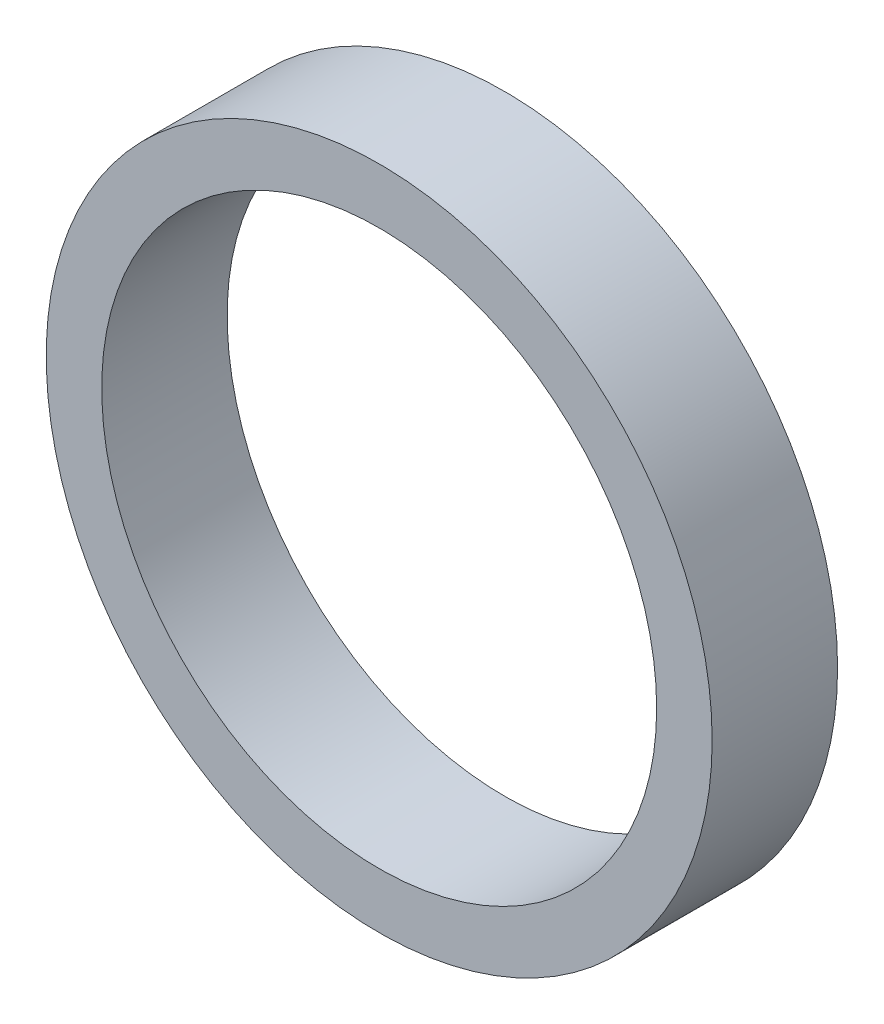
ISO-10303-21;
HEADER;
FILE_DESCRIPTION(('STEP AP214'),'2;1');
FILE_NAME('part.step','',(''),(''),'','','');
FILE_SCHEMA(('AUTOMOTIVE_DESIGN { 1 0 10303 214 1 1 1 1 }'));
ENDSEC;
DATA;
#1=APPLICATION_CONTEXT('core data for automotive mechanical design processes');
#2=APPLICATION_PROTOCOL_DEFINITION('international standard','automotive_design',2000,#1);
#3=PRODUCT_CONTEXT('',#1,'mechanical');
#4=PRODUCT('Part','Part','',(#3));
#5=PRODUCT_RELATED_PRODUCT_CATEGORY('part','',(#4));
#6=PRODUCT_DEFINITION_FORMATION('','',#4);
#7=PRODUCT_DEFINITION_CONTEXT('part definition',#1,'design');
#8=PRODUCT_DEFINITION('design','',#6,#7);
#9=PRODUCT_DEFINITION_SHAPE('','',#8);
#10=(LENGTH_UNIT() NAMED_UNIT(*) SI_UNIT(.MILLI.,.METRE.));
#11=(NAMED_UNIT(*) PLANE_ANGLE_UNIT() SI_UNIT($,.RADIAN.));
#12=(NAMED_UNIT(*) SI_UNIT($,.STERADIAN.) SOLID_ANGLE_UNIT());
#13=UNCERTAINTY_MEASURE_WITH_UNIT(LENGTH_MEASURE(1.E-05),#10,'distance_accuracy_value','');
#14=(GEOMETRIC_REPRESENTATION_CONTEXT(3) GLOBAL_UNCERTAINTY_ASSIGNED_CONTEXT((#13)) GLOBAL_UNIT_ASSIGNED_CONTEXT((#10,
#11,#12)) REPRESENTATION_CONTEXT('',''));
#15=CARTESIAN_POINT('',(0.,0.,0.));
#16=DIRECTION('',(0.,0.,1.));
#17=DIRECTION('',(1.,0.,0.));
#18=AXIS2_PLACEMENT_3D('',#15,#16,#17);
#19=CARTESIAN_POINT('',(0.,0.,5.65));
#20=DIRECTION('',(0.,0.,1.));
#21=DIRECTION('',(1.,0.,0.));
#22=AXIS2_PLACEMENT_3D('',#19,#20,#21);
#23=PLANE('',#22);
#24=CARTESIAN_POINT('',(0.,0.,5.65));
#25=DIRECTION('',(0.,0.,1.));
#26=DIRECTION('',(1.,0.,0.));
#27=AXIS2_PLACEMENT_3D('',#24,#25,#26);
#28=CIRCLE('',#27,15.);
#29=CARTESIAN_POINT('',(15.,0.,5.65));
#30=VERTEX_POINT('',#29);
#31=EDGE_CURVE('E10',#30,#30,#28,.T.);
#32=ORIENTED_EDGE('',*,*,#31,.T.);
#33=EDGE_LOOP('',(#32));
#34=FACE_BOUND('',#33,.T.);
#35=CARTESIAN_POINT('',(0.,0.,5.65));
#36=DIRECTION('',(0.,0.,1.));
#37=DIRECTION('',(1.,0.,0.));
#38=AXIS2_PLACEMENT_3D('',#35,#36,#37);
#39=CIRCLE('',#38,12.5);
#40=CARTESIAN_POINT('',(12.5,0.,5.65));
#41=VERTEX_POINT('',#40);
#42=EDGE_CURVE('E43',#41,#41,#39,.T.);
#43=ORIENTED_EDGE('',*,*,#42,.F.);
#44=EDGE_LOOP('',(#43));
#45=FACE_BOUND('',#44,.T.);
#46=ADVANCED_FACE('F32',(#34,#45),#23,.T.);
#47=CARTESIAN_POINT('',(0.,0.,0.));
#48=DIRECTION('',(0.,0.,1.));
#49=DIRECTION('',(1.,0.,0.));
#50=AXIS2_PLACEMENT_3D('',#47,#48,#49);
#51=PLANE('',#50);
#52=CARTESIAN_POINT('',(0.,0.,0.));
#53=DIRECTION('',(0.,0.,1.));
#54=DIRECTION('',(1.,0.,0.));
#55=AXIS2_PLACEMENT_3D('',#52,#53,#54);
#56=CIRCLE('',#55,15.);
#57=CARTESIAN_POINT('',(15.,0.,0.));
#58=VERTEX_POINT('',#57);
#59=EDGE_CURVE('E36',#58,#58,#56,.T.);
#60=ORIENTED_EDGE('',*,*,#59,.F.);
#61=EDGE_LOOP('',(#60));
#62=FACE_BOUND('',#61,.T.);
#63=CARTESIAN_POINT('',(0.,0.,0.));
#64=DIRECTION('',(0.,0.,1.));
#65=DIRECTION('',(1.,0.,0.));
#66=AXIS2_PLACEMENT_3D('',#63,#64,#65);
#67=CIRCLE('',#66,12.5);
#68=CARTESIAN_POINT('',(12.5,0.,0.));
#69=VERTEX_POINT('',#68);
#70=EDGE_CURVE('E45',#69,#69,#67,.T.);
#71=ORIENTED_EDGE('',*,*,#70,.T.);
#72=EDGE_LOOP('',(#71));
#73=FACE_BOUND('',#72,.T.);
#74=ADVANCED_FACE('F55',(#62,#73),#51,.F.);
#75=CARTESIAN_POINT('',(0.,0.,5.65));
#76=DIRECTION('',(0.,0.,-1.));
#77=DIRECTION('',(-1.,0.,0.));
#78=AXIS2_PLACEMENT_3D('',#75,#76,#77);
#79=CYLINDRICAL_SURFACE('',#78,15.);
#80=ORIENTED_EDGE('',*,*,#31,.F.);
#81=EDGE_LOOP('',(#80));
#82=FACE_BOUND('',#81,.T.);
#83=ORIENTED_EDGE('',*,*,#59,.T.);
#84=EDGE_LOOP('',(#83));
#85=FACE_BOUND('',#84,.T.);
#86=ADVANCED_FACE('F34',(#82,#85),#79,.T.);
#87=CARTESIAN_POINT('',(0.,0.,5.65));
#88=DIRECTION('',(0.,0.,-1.));
#89=DIRECTION('',(-1.,0.,0.));
#90=AXIS2_PLACEMENT_3D('',#87,#88,#89);
#91=CYLINDRICAL_SURFACE('',#90,12.5);
#92=ORIENTED_EDGE('',*,*,#42,.T.);
#93=EDGE_LOOP('',(#92));
#94=FACE_BOUND('',#93,.T.);
#95=ORIENTED_EDGE('',*,*,#70,.F.);
#96=EDGE_LOOP('',(#95));
#97=FACE_BOUND('',#96,.T.);
#98=ADVANCED_FACE('F51',(#94,#97),#91,.F.);
#99=CLOSED_SHELL('',(#46,#74,#86,#98));
#100=MANIFOLD_SOLID_BREP('B2',#99);
#101=ADVANCED_BREP_SHAPE_REPRESENTATION('',(#18,#100),#14);
#102=SHAPE_DEFINITION_REPRESENTATION(#9,#101);
ENDSEC;
END-ISO-10303-21;
